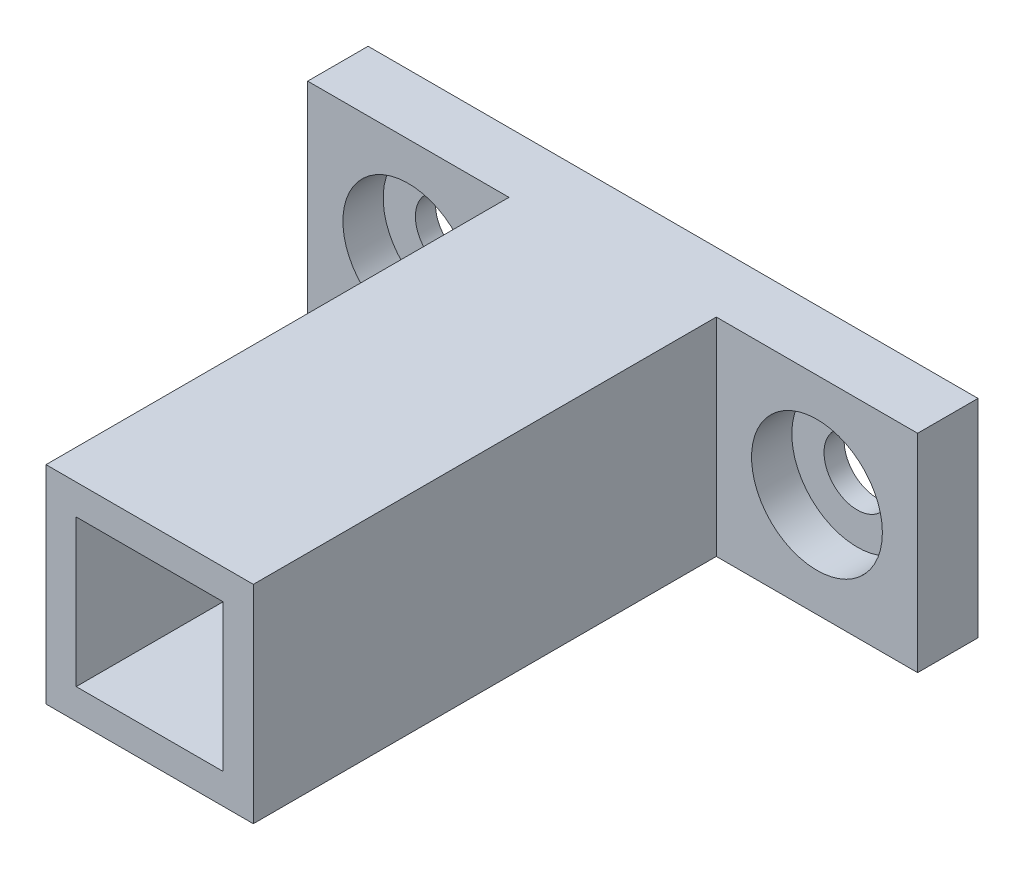
ISO-10303-21;
HEADER;
FILE_DESCRIPTION(('STEP AP214'),'2;1');
FILE_NAME('part.step','',(''),(''),'','','');
FILE_SCHEMA(('AUTOMOTIVE_DESIGN { 1 0 10303 214 1 1 1 1 }'));
ENDSEC;
DATA;
#1=APPLICATION_CONTEXT('core data for automotive mechanical design processes');
#2=APPLICATION_PROTOCOL_DEFINITION('international standard','automotive_design',2000,#1);
#3=PRODUCT_CONTEXT('',#1,'mechanical');
#4=PRODUCT('Part','Part','',(#3));
#5=PRODUCT_RELATED_PRODUCT_CATEGORY('part','',(#4));
#6=PRODUCT_DEFINITION_FORMATION('','',#4);
#7=PRODUCT_DEFINITION_CONTEXT('part definition',#1,'design');
#8=PRODUCT_DEFINITION('design','',#6,#7);
#9=PRODUCT_DEFINITION_SHAPE('','',#8);
#10=(LENGTH_UNIT() NAMED_UNIT(*) SI_UNIT(.MILLI.,.METRE.));
#11=(NAMED_UNIT(*) PLANE_ANGLE_UNIT() SI_UNIT($,.RADIAN.));
#12=(NAMED_UNIT(*) SI_UNIT($,.STERADIAN.) SOLID_ANGLE_UNIT());
#13=UNCERTAINTY_MEASURE_WITH_UNIT(LENGTH_MEASURE(1.E-05),#10,'distance_accuracy_value','');
#14=(GEOMETRIC_REPRESENTATION_CONTEXT(3) GLOBAL_UNCERTAINTY_ASSIGNED_CONTEXT((#13)) GLOBAL_UNIT_ASSIGNED_CONTEXT((#10,
#11,#12)) REPRESENTATION_CONTEXT('',''));
#15=CARTESIAN_POINT('',(0.,0.,0.));
#16=DIRECTION('',(0.,0.,1.));
#17=DIRECTION('',(1.,0.,0.));
#18=AXIS2_PLACEMENT_3D('',#15,#16,#17);
#19=CARTESIAN_POINT('',(-46.323903103577,61.9826798799258,3.));
#20=DIRECTION('',(0.,0.,-1.));
#21=DIRECTION('',(-1.,0.,0.));
#22=AXIS2_PLACEMENT_3D('',#19,#20,#21);
#23=CYLINDRICAL_SURFACE('',#22,1.65);
#24=CARTESIAN_POINT('',(-46.323903103577,61.9826798799258,0.));
#25=DIRECTION('',(0.,0.,1.));
#26=DIRECTION('',(1.,0.,0.));
#27=AXIS2_PLACEMENT_3D('',#24,#25,#26);
#28=CIRCLE('',#27,1.65);
#29=CARTESIAN_POINT('',(-44.673903103577,61.9826798799258,0.));
#30=VERTEX_POINT('',#29);
#31=EDGE_CURVE('E154',#30,#30,#28,.T.);
#32=ORIENTED_EDGE('',*,*,#31,.F.);
#33=EDGE_LOOP('',(#32));
#34=FACE_BOUND('',#33,.T.);
#35=CARTESIAN_POINT('',(-46.323903103577,61.9826798799258,1.));
#36=DIRECTION('',(0.,0.,1.));
#37=DIRECTION('',(1.,0.,0.));
#38=AXIS2_PLACEMENT_3D('',#35,#36,#37);
#39=CIRCLE('',#38,1.65);
#40=CARTESIAN_POINT('',(-44.673903103577,61.9826798799258,1.));
#41=VERTEX_POINT('',#40);
#42=EDGE_CURVE('E36',#41,#41,#39,.T.);
#43=ORIENTED_EDGE('',*,*,#42,.T.);
#44=EDGE_LOOP('',(#43));
#45=FACE_BOUND('',#44,.T.);
#46=ADVANCED_FACE('F32',(#34,#45),#23,.F.);
#47=CARTESIAN_POINT('',(-66.623903103577,61.9826798799258,3.));
#48=DIRECTION('',(0.,0.,-1.));
#49=DIRECTION('',(-1.,0.,0.));
#50=AXIS2_PLACEMENT_3D('',#47,#48,#49);
#51=CYLINDRICAL_SURFACE('',#50,1.65);
#52=CARTESIAN_POINT('',(-66.623903103577,61.9826798799258,0.));
#53=DIRECTION('',(0.,0.,1.));
#54=DIRECTION('',(1.,0.,0.));
#55=AXIS2_PLACEMENT_3D('',#52,#53,#54);
#56=CIRCLE('',#55,1.65);
#57=CARTESIAN_POINT('',(-64.973903103577,61.9826798799258,0.));
#58=VERTEX_POINT('',#57);
#59=EDGE_CURVE('E143',#58,#58,#56,.T.);
#60=ORIENTED_EDGE('',*,*,#59,.F.);
#61=EDGE_LOOP('',(#60));
#62=FACE_BOUND('',#61,.T.);
#63=CARTESIAN_POINT('',(-66.623903103577,61.9826798799258,1.));
#64=DIRECTION('',(0.,0.,1.));
#65=DIRECTION('',(1.,0.,0.));
#66=AXIS2_PLACEMENT_3D('',#63,#64,#65);
#67=CIRCLE('',#66,1.65);
#68=CARTESIAN_POINT('',(-64.973903103577,61.9826798799258,1.));
#69=VERTEX_POINT('',#68);
#70=EDGE_CURVE('E220',#69,#69,#67,.T.);
#71=ORIENTED_EDGE('',*,*,#70,.T.);
#72=EDGE_LOOP('',(#71));
#73=FACE_BOUND('',#72,.T.);
#74=ADVANCED_FACE('F263',(#62,#73),#51,.F.);
#75=CARTESIAN_POINT('',(-61.623903103577,67.1326798799259,26.));
#76=DIRECTION('',(1.,0.,0.));
#77=DIRECTION('',(0.,0.,-1.));
#78=AXIS2_PLACEMENT_3D('',#75,#76,#77);
#79=PLANE('',#78);
#80=DIRECTION('',(0.,1.,0.));
#81=VECTOR('',#80,1.);
#82=CARTESIAN_POINT('',(-61.623903103577,67.1326798799259,3.));
#83=LINE('',#82,#81);
#84=CARTESIAN_POINT('',(-61.623903103577,56.8326798799258,3.00000000000001));
#85=VERTEX_POINT('',#84);
#86=CARTESIAN_POINT('',(-61.623903103577,67.1326798799259,3.));
#87=VERTEX_POINT('',#86);
#88=EDGE_CURVE('E48',#85,#87,#83,.T.);
#89=ORIENTED_EDGE('',*,*,#88,.F.);
#90=DIRECTION('',(0.,0.,-1.));
#91=VECTOR('',#90,1.);
#92=CARTESIAN_POINT('',(-61.623903103577,56.8326798799258,26.));
#93=LINE('',#92,#91);
#94=CARTESIAN_POINT('',(-61.623903103577,56.8326798799258,26.));
#95=VERTEX_POINT('',#94);
#96=EDGE_CURVE('E41',#95,#85,#93,.T.);
#97=ORIENTED_EDGE('',*,*,#96,.F.);
#98=DIRECTION('',(0.,-1.,0.));
#99=VECTOR('',#98,1.);
#100=CARTESIAN_POINT('',(-61.623903103577,67.1326798799259,26.));
#101=LINE('',#100,#99);
#102=CARTESIAN_POINT('',(-61.623903103577,67.1326798799259,26.));
#103=VERTEX_POINT('',#102);
#104=EDGE_CURVE('E124',#103,#95,#101,.T.);
#105=ORIENTED_EDGE('',*,*,#104,.F.);
#106=DIRECTION('',(0.,0.,-1.));
#107=VECTOR('',#106,1.);
#108=CARTESIAN_POINT('',(-61.623903103577,67.1326798799259,26.));
#109=LINE('',#108,#107);
#110=EDGE_CURVE('E11',#103,#87,#109,.T.);
#111=ORIENTED_EDGE('',*,*,#110,.T.);
#112=EDGE_LOOP('',(#89,#97,#105,#111));
#113=FACE_BOUND('',#112,.T.);
#114=ADVANCED_FACE('F123',(#113),#79,.F.);
#115=CARTESIAN_POINT('',(-51.323903103577,67.1326798799259,26.));
#116=DIRECTION('',(-1.,0.,0.));
#117=DIRECTION('',(0.,0.,1.));
#118=AXIS2_PLACEMENT_3D('',#115,#116,#117);
#119=PLANE('',#118);
#120=DIRECTION('',(0.,-1.,0.));
#121=VECTOR('',#120,1.);
#122=CARTESIAN_POINT('',(-51.323903103577,67.1326798799259,3.));
#123=LINE('',#122,#121);
#124=CARTESIAN_POINT('',(-51.323903103577,67.1326798799259,3.00000000000001));
#125=VERTEX_POINT('',#124);
#126=CARTESIAN_POINT('',(-51.323903103577,56.8326798799258,3.));
#127=VERTEX_POINT('',#126);
#128=EDGE_CURVE('E56',#125,#127,#123,.T.);
#129=ORIENTED_EDGE('',*,*,#128,.F.);
#130=DIRECTION('',(0.,0.,-1.));
#131=VECTOR('',#130,1.);
#132=CARTESIAN_POINT('',(-51.323903103577,67.1326798799259,26.));
#133=LINE('',#132,#131);
#134=CARTESIAN_POINT('',(-51.323903103577,67.1326798799259,26.));
#135=VERTEX_POINT('',#134);
#136=EDGE_CURVE('E214',#135,#125,#133,.T.);
#137=ORIENTED_EDGE('',*,*,#136,.F.);
#138=DIRECTION('',(0.,1.,0.));
#139=VECTOR('',#138,1.);
#140=CARTESIAN_POINT('',(-51.323903103577,67.1326798799259,26.));
#141=LINE('',#140,#139);
#142=CARTESIAN_POINT('',(-51.323903103577,56.8326798799258,26.));
#143=VERTEX_POINT('',#142);
#144=EDGE_CURVE('E212',#143,#135,#141,.T.);
#145=ORIENTED_EDGE('',*,*,#144,.F.);
#146=DIRECTION('',(0.,0.,-1.));
#147=VECTOR('',#146,1.);
#148=CARTESIAN_POINT('',(-51.323903103577,56.8326798799258,26.));
#149=LINE('',#148,#147);
#150=EDGE_CURVE('E218',#143,#127,#149,.T.);
#151=ORIENTED_EDGE('',*,*,#150,.T.);
#152=EDGE_LOOP('',(#129,#137,#145,#151));
#153=FACE_BOUND('',#152,.T.);
#154=ADVANCED_FACE('F297',(#153),#119,.F.);
#155=CARTESIAN_POINT('',(0.,0.,26.));
#156=DIRECTION('',(0.,0.,-1.));
#157=DIRECTION('',(-1.,0.,0.));
#158=AXIS2_PLACEMENT_3D('',#155,#156,#157);
#159=PLANE('',#158);
#160=DIRECTION('',(-1.,0.,0.));
#161=VECTOR('',#160,1.);
#162=CARTESIAN_POINT('',(-61.623903103577,67.1326798799259,26.));
#163=LINE('',#162,#161);
#164=EDGE_CURVE('E206',#135,#103,#163,.T.);
#165=ORIENTED_EDGE('',*,*,#164,.T.);
#166=ORIENTED_EDGE('',*,*,#104,.T.);
#167=DIRECTION('',(1.,0.,0.));
#168=VECTOR('',#167,1.);
#169=CARTESIAN_POINT('',(-61.623903103577,56.8326798799258,26.));
#170=LINE('',#169,#168);
#171=EDGE_CURVE('E210',#95,#143,#170,.T.);
#172=ORIENTED_EDGE('',*,*,#171,.T.);
#173=ORIENTED_EDGE('',*,*,#144,.T.);
#174=EDGE_LOOP('',(#165,#166,#172,#173));
#175=FACE_BOUND('',#174,.T.);
#176=DIRECTION('',(-1.,0.,0.));
#177=VECTOR('',#176,1.);
#178=CARTESIAN_POINT('',(-60.123903103577,65.6326798799259,26.));
#179=LINE('',#178,#177);
#180=CARTESIAN_POINT('',(-52.823903103577,65.6326798799259,26.));
#181=VERTEX_POINT('',#180);
#182=CARTESIAN_POINT('',(-60.123903103577,65.6326798799259,26.));
#183=VERTEX_POINT('',#182);
#184=EDGE_CURVE('E175',#181,#183,#179,.T.);
#185=ORIENTED_EDGE('',*,*,#184,.F.);
#186=DIRECTION('',(0.,1.,0.));
#187=VECTOR('',#186,1.);
#188=CARTESIAN_POINT('',(-52.823903103577,65.6326798799259,26.));
#189=LINE('',#188,#187);
#190=CARTESIAN_POINT('',(-52.823903103577,58.3326798799258,26.));
#191=VERTEX_POINT('',#190);
#192=EDGE_CURVE('E183',#191,#181,#189,.T.);
#193=ORIENTED_EDGE('',*,*,#192,.F.);
#194=DIRECTION('',(1.,0.,0.));
#195=VECTOR('',#194,1.);
#196=CARTESIAN_POINT('',(-60.123903103577,58.3326798799258,26.));
#197=LINE('',#196,#195);
#198=CARTESIAN_POINT('',(-60.123903103577,58.3326798799258,26.));
#199=VERTEX_POINT('',#198);
#200=EDGE_CURVE('E180',#199,#191,#197,.T.);
#201=ORIENTED_EDGE('',*,*,#200,.F.);
#202=DIRECTION('',(0.,-1.,0.));
#203=VECTOR('',#202,1.);
#204=CARTESIAN_POINT('',(-60.123903103577,65.6326798799259,26.));
#205=LINE('',#204,#203);
#206=EDGE_CURVE('E177',#183,#199,#205,.T.);
#207=ORIENTED_EDGE('',*,*,#206,.F.);
#208=EDGE_LOOP('',(#185,#193,#201,#207));
#209=FACE_BOUND('',#208,.T.);
#210=ADVANCED_FACE('F293',(#175,#209),#159,.F.);
#211=CARTESIAN_POINT('',(0.,0.,0.));
#212=DIRECTION('',(0.,0.,-1.));
#213=DIRECTION('',(-1.,0.,0.));
#214=AXIS2_PLACEMENT_3D('',#211,#212,#213);
#215=PLANE('',#214);
#216=DIRECTION('',(-1.,0.,0.));
#217=VECTOR('',#216,1.);
#218=CARTESIAN_POINT('',(-61.623903103577,67.1326798799259,0.));
#219=LINE('',#218,#217);
#220=CARTESIAN_POINT('',(-41.323903103577,67.1326798799259,0.));
#221=VERTEX_POINT('',#220);
#222=CARTESIAN_POINT('',(-71.623903103577,67.1326798799259,0.));
#223=VERTEX_POINT('',#222);
#224=EDGE_CURVE('E205',#221,#223,#219,.T.);
#225=ORIENTED_EDGE('',*,*,#224,.F.);
#226=DIRECTION('',(0.,1.,0.));
#227=VECTOR('',#226,1.);
#228=CARTESIAN_POINT('',(-41.323903103577,67.1326798799259,0.));
#229=LINE('',#228,#227);
#230=CARTESIAN_POINT('',(-41.323903103577,56.8326798799258,0.));
#231=VERTEX_POINT('',#230);
#232=EDGE_CURVE('E157',#231,#221,#229,.T.);
#233=ORIENTED_EDGE('',*,*,#232,.F.);
#234=DIRECTION('',(1.,0.,0.));
#235=VECTOR('',#234,1.);
#236=CARTESIAN_POINT('',(-61.623903103577,56.8326798799258,0.));
#237=LINE('',#236,#235);
#238=CARTESIAN_POINT('',(-71.623903103577,56.8326798799258,0.));
#239=VERTEX_POINT('',#238);
#240=EDGE_CURVE('E208',#239,#231,#237,.T.);
#241=ORIENTED_EDGE('',*,*,#240,.F.);
#242=DIRECTION('',(0.,-1.,0.));
#243=VECTOR('',#242,1.);
#244=CARTESIAN_POINT('',(-71.623903103577,67.1326798799259,0.));
#245=LINE('',#244,#243);
#246=EDGE_CURVE('E140',#223,#239,#245,.T.);
#247=ORIENTED_EDGE('',*,*,#246,.F.);
#248=EDGE_LOOP('',(#225,#233,#241,#247));
#249=FACE_BOUND('',#248,.T.);
#250=DIRECTION('',(0.,1.,0.));
#251=VECTOR('',#250,1.);
#252=CARTESIAN_POINT('',(-52.823903103577,65.6326798799259,0.));
#253=LINE('',#252,#251);
#254=CARTESIAN_POINT('',(-52.823903103577,58.3326798799258,0.));
#255=VERTEX_POINT('',#254);
#256=CARTESIAN_POINT('',(-52.823903103577,65.6326798799259,0.));
#257=VERTEX_POINT('',#256);
#258=EDGE_CURVE('E178',#255,#257,#253,.T.);
#259=ORIENTED_EDGE('',*,*,#258,.T.);
#260=DIRECTION('',(-1.,0.,0.));
#261=VECTOR('',#260,1.);
#262=CARTESIAN_POINT('',(-60.123903103577,65.6326798799259,0.));
#263=LINE('',#262,#261);
#264=CARTESIAN_POINT('',(-60.123903103577,65.6326798799259,0.));
#265=VERTEX_POINT('',#264);
#266=EDGE_CURVE('E174',#257,#265,#263,.T.);
#267=ORIENTED_EDGE('',*,*,#266,.T.);
#268=DIRECTION('',(0.,-1.,0.));
#269=VECTOR('',#268,1.);
#270=CARTESIAN_POINT('',(-60.123903103577,65.6326798799259,0.));
#271=LINE('',#270,#269);
#272=CARTESIAN_POINT('',(-60.123903103577,58.3326798799258,0.));
#273=VERTEX_POINT('',#272);
#274=EDGE_CURVE('E188',#265,#273,#271,.T.);
#275=ORIENTED_EDGE('',*,*,#274,.T.);
#276=DIRECTION('',(1.,0.,0.));
#277=VECTOR('',#276,1.);
#278=CARTESIAN_POINT('',(-60.123903103577,58.3326798799258,0.));
#279=LINE('',#278,#277);
#280=EDGE_CURVE('E191',#273,#255,#279,.T.);
#281=ORIENTED_EDGE('',*,*,#280,.T.);
#282=EDGE_LOOP('',(#259,#267,#275,#281));
#283=FACE_BOUND('',#282,.T.);
#284=ORIENTED_EDGE('',*,*,#31,.T.);
#285=EDGE_LOOP('',(#284));
#286=FACE_BOUND('',#285,.T.);
#287=ORIENTED_EDGE('',*,*,#59,.T.);
#288=EDGE_LOOP('',(#287));
#289=FACE_BOUND('',#288,.T.);
#290=ADVANCED_FACE('F296',(#249,#283,#286,#289),#215,.T.);
#291=CARTESIAN_POINT('',(-61.623903103577,67.1326798799259,26.));
#292=DIRECTION('',(0.,-1.,0.));
#293=DIRECTION('',(0.,0.,-1.));
#294=AXIS2_PLACEMENT_3D('',#291,#292,#293);
#295=PLANE('',#294);
#296=ORIENTED_EDGE('',*,*,#224,.T.);
#297=DIRECTION('',(0.,0.,-1.));
#298=VECTOR('',#297,1.);
#299=CARTESIAN_POINT('',(-71.623903103577,67.1326798799259,3.));
#300=LINE('',#299,#298);
#301=CARTESIAN_POINT('',(-71.623903103577,67.1326798799259,3.));
#302=VERTEX_POINT('',#301);
#303=EDGE_CURVE('E131',#302,#223,#300,.T.);
#304=ORIENTED_EDGE('',*,*,#303,.F.);
#305=DIRECTION('',(-1.,0.,0.));
#306=VECTOR('',#305,1.);
#307=CARTESIAN_POINT('',(-61.623903103577,67.1326798799259,3.));
#308=LINE('',#307,#306);
#309=EDGE_CURVE('E129',#87,#302,#308,.T.);
#310=ORIENTED_EDGE('',*,*,#309,.F.);
#311=ORIENTED_EDGE('',*,*,#110,.F.);
#312=ORIENTED_EDGE('',*,*,#164,.F.);
#313=ORIENTED_EDGE('',*,*,#136,.T.);
#314=DIRECTION('',(-1.,0.,0.));
#315=VECTOR('',#314,1.);
#316=CARTESIAN_POINT('',(-51.323903103577,67.1326798799259,3.));
#317=LINE('',#316,#315);
#318=CARTESIAN_POINT('',(-41.323903103577,67.1326798799259,3.));
#319=VERTEX_POINT('',#318);
#320=EDGE_CURVE('E163',#319,#125,#317,.T.);
#321=ORIENTED_EDGE('',*,*,#320,.F.);
#322=DIRECTION('',(0.,0.,-1.));
#323=VECTOR('',#322,1.);
#324=CARTESIAN_POINT('',(-41.323903103577,67.1326798799259,3.));
#325=LINE('',#324,#323);
#326=EDGE_CURVE('E166',#319,#221,#325,.T.);
#327=ORIENTED_EDGE('',*,*,#326,.T.);
#328=EDGE_LOOP('',(#296,#304,#310,#311,#312,#313,#321,#327));
#329=FACE_BOUND('',#328,.T.);
#330=ADVANCED_FACE('F34',(#329),#295,.F.);
#331=CARTESIAN_POINT('',(-61.623903103577,56.8326798799258,26.));
#332=DIRECTION('',(0.,1.,0.));
#333=DIRECTION('',(0.,0.,1.));
#334=AXIS2_PLACEMENT_3D('',#331,#332,#333);
#335=PLANE('',#334);
#336=ORIENTED_EDGE('',*,*,#240,.T.);
#337=DIRECTION('',(0.,0.,-1.));
#338=VECTOR('',#337,1.);
#339=CARTESIAN_POINT('',(-41.323903103577,56.8326798799258,3.));
#340=LINE('',#339,#338);
#341=CARTESIAN_POINT('',(-41.323903103577,56.8326798799258,3.));
#342=VERTEX_POINT('',#341);
#343=EDGE_CURVE('E171',#342,#231,#340,.T.);
#344=ORIENTED_EDGE('',*,*,#343,.F.);
#345=DIRECTION('',(1.,0.,0.));
#346=VECTOR('',#345,1.);
#347=CARTESIAN_POINT('',(-51.323903103577,56.8326798799258,3.));
#348=LINE('',#347,#346);
#349=EDGE_CURVE('E159',#127,#342,#348,.T.);
#350=ORIENTED_EDGE('',*,*,#349,.F.);
#351=ORIENTED_EDGE('',*,*,#150,.F.);
#352=ORIENTED_EDGE('',*,*,#171,.F.);
#353=ORIENTED_EDGE('',*,*,#96,.T.);
#354=DIRECTION('',(1.,0.,0.));
#355=VECTOR('',#354,1.);
#356=CARTESIAN_POINT('',(-61.623903103577,56.8326798799258,3.));
#357=LINE('',#356,#355);
#358=CARTESIAN_POINT('',(-71.623903103577,56.8326798799258,3.));
#359=VERTEX_POINT('',#358);
#360=EDGE_CURVE('E139',#359,#85,#357,.T.);
#361=ORIENTED_EDGE('',*,*,#360,.F.);
#362=DIRECTION('',(0.,0.,-1.));
#363=VECTOR('',#362,1.);
#364=CARTESIAN_POINT('',(-71.623903103577,56.8326798799258,3.));
#365=LINE('',#364,#363);
#366=EDGE_CURVE('E149',#359,#239,#365,.T.);
#367=ORIENTED_EDGE('',*,*,#366,.T.);
#368=EDGE_LOOP('',(#336,#344,#350,#351,#352,#353,#361,#367));
#369=FACE_BOUND('',#368,.T.);
#370=ADVANCED_FACE('F291',(#369),#335,.F.);
#371=CARTESIAN_POINT('',(-60.123903103577,65.6326798799259,26.));
#372=DIRECTION('',(0.,-1.,0.));
#373=DIRECTION('',(1.,0.,0.));
#374=AXIS2_PLACEMENT_3D('',#371,#372,#373);
#375=PLANE('',#374);
#376=ORIENTED_EDGE('',*,*,#266,.F.);
#377=DIRECTION('',(0.,0.,-1.));
#378=VECTOR('',#377,1.);
#379=CARTESIAN_POINT('',(-52.823903103577,65.6326798799259,26.));
#380=LINE('',#379,#378);
#381=EDGE_CURVE('E185',#181,#257,#380,.T.);
#382=ORIENTED_EDGE('',*,*,#381,.F.);
#383=ORIENTED_EDGE('',*,*,#184,.T.);
#384=DIRECTION('',(0.,0.,-1.));
#385=VECTOR('',#384,1.);
#386=CARTESIAN_POINT('',(-60.123903103577,65.6326798799259,26.));
#387=LINE('',#386,#385);
#388=EDGE_CURVE('E202',#183,#265,#387,.T.);
#389=ORIENTED_EDGE('',*,*,#388,.T.);
#390=EDGE_LOOP('',(#376,#382,#383,#389));
#391=FACE_BOUND('',#390,.T.);
#392=ADVANCED_FACE('F287',(#391),#375,.T.);
#393=CARTESIAN_POINT('',(-60.123903103577,65.6326798799259,26.));
#394=DIRECTION('',(1.,0.,0.));
#395=DIRECTION('',(0.,0.,-1.));
#396=AXIS2_PLACEMENT_3D('',#393,#394,#395);
#397=PLANE('',#396);
#398=ORIENTED_EDGE('',*,*,#274,.F.);
#399=ORIENTED_EDGE('',*,*,#388,.F.);
#400=ORIENTED_EDGE('',*,*,#206,.T.);
#401=DIRECTION('',(0.,0.,-1.));
#402=VECTOR('',#401,1.);
#403=CARTESIAN_POINT('',(-60.123903103577,58.3326798799258,26.));
#404=LINE('',#403,#402);
#405=EDGE_CURVE('E200',#199,#273,#404,.T.);
#406=ORIENTED_EDGE('',*,*,#405,.T.);
#407=EDGE_LOOP('',(#398,#399,#400,#406));
#408=FACE_BOUND('',#407,.T.);
#409=ADVANCED_FACE('F283',(#408),#397,.T.);
#410=CARTESIAN_POINT('',(-60.123903103577,58.3326798799258,26.));
#411=DIRECTION('',(0.,1.,0.));
#412=DIRECTION('',(-1.,0.,0.));
#413=AXIS2_PLACEMENT_3D('',#410,#411,#412);
#414=PLANE('',#413);
#415=ORIENTED_EDGE('',*,*,#280,.F.);
#416=ORIENTED_EDGE('',*,*,#405,.F.);
#417=ORIENTED_EDGE('',*,*,#200,.T.);
#418=DIRECTION('',(0.,0.,-1.));
#419=VECTOR('',#418,1.);
#420=CARTESIAN_POINT('',(-52.823903103577,58.3326798799258,26.));
#421=LINE('',#420,#419);
#422=EDGE_CURVE('E198',#191,#255,#421,.T.);
#423=ORIENTED_EDGE('',*,*,#422,.T.);
#424=EDGE_LOOP('',(#415,#416,#417,#423));
#425=FACE_BOUND('',#424,.T.);
#426=ADVANCED_FACE('F279',(#425),#414,.T.);
#427=CARTESIAN_POINT('',(-52.823903103577,65.6326798799259,26.));
#428=DIRECTION('',(-1.,0.,0.));
#429=DIRECTION('',(0.,0.,1.));
#430=AXIS2_PLACEMENT_3D('',#427,#428,#429);
#431=PLANE('',#430);
#432=ORIENTED_EDGE('',*,*,#258,.F.);
#433=ORIENTED_EDGE('',*,*,#422,.F.);
#434=ORIENTED_EDGE('',*,*,#192,.T.);
#435=ORIENTED_EDGE('',*,*,#381,.T.);
#436=EDGE_LOOP('',(#432,#433,#434,#435));
#437=FACE_BOUND('',#436,.T.);
#438=ADVANCED_FACE('F274',(#437),#431,.T.);
#439=CARTESIAN_POINT('',(0.,0.,3.));
#440=DIRECTION('',(0.,0.,1.));
#441=DIRECTION('',(1.,0.,0.));
#442=AXIS2_PLACEMENT_3D('',#439,#440,#441);
#443=PLANE('',#442);
#444=CARTESIAN_POINT('',(-46.323903103577,61.9826798799258,3.));
#445=DIRECTION('',(0.,0.,1.));
#446=DIRECTION('',(1.,0.,0.));
#447=AXIS2_PLACEMENT_3D('',#444,#445,#446);
#448=CIRCLE('',#447,3.25);
#449=CARTESIAN_POINT('',(-43.073903103577,61.9826798799258,3.));
#450=VERTEX_POINT('',#449);
#451=EDGE_CURVE('E227',#450,#450,#448,.T.);
#452=ORIENTED_EDGE('',*,*,#451,.F.);
#453=EDGE_LOOP('',(#452));
#454=FACE_BOUND('',#453,.T.);
#455=ORIENTED_EDGE('',*,*,#128,.T.);
#456=ORIENTED_EDGE('',*,*,#349,.T.);
#457=DIRECTION('',(0.,1.,0.));
#458=VECTOR('',#457,1.);
#459=CARTESIAN_POINT('',(-41.323903103577,67.1326798799259,3.));
#460=LINE('',#459,#458);
#461=EDGE_CURVE('E161',#342,#319,#460,.T.);
#462=ORIENTED_EDGE('',*,*,#461,.T.);
#463=ORIENTED_EDGE('',*,*,#320,.T.);
#464=EDGE_LOOP('',(#455,#456,#462,#463));
#465=FACE_BOUND('',#464,.T.);
#466=ADVANCED_FACE('F258',(#454,#465),#443,.T.);
#467=CARTESIAN_POINT('',(-41.323903103577,67.1326798799259,3.));
#468=DIRECTION('',(-1.,0.,0.));
#469=DIRECTION('',(0.,0.,1.));
#470=AXIS2_PLACEMENT_3D('',#467,#468,#469);
#471=PLANE('',#470);
#472=ORIENTED_EDGE('',*,*,#232,.T.);
#473=ORIENTED_EDGE('',*,*,#326,.F.);
#474=ORIENTED_EDGE('',*,*,#461,.F.);
#475=ORIENTED_EDGE('',*,*,#343,.T.);
#476=EDGE_LOOP('',(#472,#473,#474,#475));
#477=FACE_BOUND('',#476,.T.);
#478=ADVANCED_FACE('F250',(#477),#471,.F.);
#479=CARTESIAN_POINT('',(0.,0.,3.));
#480=DIRECTION('',(0.,0.,-1.));
#481=DIRECTION('',(-1.,0.,0.));
#482=AXIS2_PLACEMENT_3D('',#479,#480,#481);
#483=PLANE('',#482);
#484=CARTESIAN_POINT('',(-66.623903103577,61.9826798799258,3.));
#485=DIRECTION('',(0.,0.,1.));
#486=DIRECTION('',(1.,0.,0.));
#487=AXIS2_PLACEMENT_3D('',#484,#485,#486);
#488=CIRCLE('',#487,3.25000000000001);
#489=CARTESIAN_POINT('',(-63.373903103577,61.9826798799258,3.));
#490=VERTEX_POINT('',#489);
#491=EDGE_CURVE('E232',#490,#490,#488,.T.);
#492=ORIENTED_EDGE('',*,*,#491,.F.);
#493=EDGE_LOOP('',(#492));
#494=FACE_BOUND('',#493,.T.);
#495=ORIENTED_EDGE('',*,*,#88,.T.);
#496=ORIENTED_EDGE('',*,*,#309,.T.);
#497=DIRECTION('',(0.,-1.,0.));
#498=VECTOR('',#497,1.);
#499=CARTESIAN_POINT('',(-71.623903103577,67.1326798799259,3.));
#500=LINE('',#499,#498);
#501=EDGE_CURVE('E134',#302,#359,#500,.T.);
#502=ORIENTED_EDGE('',*,*,#501,.T.);
#503=ORIENTED_EDGE('',*,*,#360,.T.);
#504=EDGE_LOOP('',(#495,#496,#502,#503));
#505=FACE_BOUND('',#504,.T.);
#506=ADVANCED_FACE('F137',(#494,#505),#483,.F.);
#507=CARTESIAN_POINT('',(-71.623903103577,67.1326798799259,3.));
#508=DIRECTION('',(1.,0.,0.));
#509=DIRECTION('',(0.,0.,-1.));
#510=AXIS2_PLACEMENT_3D('',#507,#508,#509);
#511=PLANE('',#510);
#512=ORIENTED_EDGE('',*,*,#246,.T.);
#513=ORIENTED_EDGE('',*,*,#366,.F.);
#514=ORIENTED_EDGE('',*,*,#501,.F.);
#515=ORIENTED_EDGE('',*,*,#303,.T.);
#516=EDGE_LOOP('',(#512,#513,#514,#515));
#517=FACE_BOUND('',#516,.T.);
#518=ADVANCED_FACE('F245',(#517),#511,.F.);
#519=CARTESIAN_POINT('',(-66.623903103577,61.9826798799258,1.));
#520=DIRECTION('',(0.,0.,1.));
#521=DIRECTION('',(1.,0.,0.));
#522=AXIS2_PLACEMENT_3D('',#519,#520,#521);
#523=CYLINDRICAL_SURFACE('',#522,3.25000000000001);
#524=CARTESIAN_POINT('',(-66.623903103577,61.9826798799258,1.));
#525=DIRECTION('',(0.,0.,1.));
#526=DIRECTION('',(1.,0.,0.));
#527=AXIS2_PLACEMENT_3D('',#524,#525,#526);
#528=CIRCLE('',#527,3.25000000000001);
#529=CARTESIAN_POINT('',(-63.373903103577,61.9826798799258,1.));
#530=VERTEX_POINT('',#529);
#531=EDGE_CURVE('E236',#530,#530,#528,.T.);
#532=ORIENTED_EDGE('',*,*,#531,.F.);
#533=EDGE_LOOP('',(#532));
#534=FACE_BOUND('',#533,.T.);
#535=ORIENTED_EDGE('',*,*,#491,.T.);
#536=EDGE_LOOP('',(#535));
#537=FACE_BOUND('',#536,.T.);
#538=ADVANCED_FACE('F242',(#534,#537),#523,.F.);
#539=CARTESIAN_POINT('',(-66.623903103577,61.9826798799258,1.));
#540=DIRECTION('',(0.,0.,1.));
#541=DIRECTION('',(1.,0.,0.));
#542=AXIS2_PLACEMENT_3D('',#539,#540,#541);
#543=PLANE('',#542);
#544=ORIENTED_EDGE('',*,*,#70,.F.);
#545=EDGE_LOOP('',(#544));
#546=FACE_BOUND('',#545,.T.);
#547=ORIENTED_EDGE('',*,*,#531,.T.);
#548=EDGE_LOOP('',(#547));
#549=FACE_BOUND('',#548,.T.);
#550=ADVANCED_FACE('F240',(#546,#549),#543,.T.);
#551=CARTESIAN_POINT('',(-46.323903103577,61.9826798799258,1.));
#552=DIRECTION('',(0.,0.,1.));
#553=DIRECTION('',(1.,0.,0.));
#554=AXIS2_PLACEMENT_3D('',#551,#552,#553);
#555=CYLINDRICAL_SURFACE('',#554,3.25);
#556=CARTESIAN_POINT('',(-46.323903103577,61.9826798799258,1.));
#557=DIRECTION('',(0.,0.,1.));
#558=DIRECTION('',(1.,0.,0.));
#559=AXIS2_PLACEMENT_3D('',#556,#557,#558);
#560=CIRCLE('',#559,3.25);
#561=CARTESIAN_POINT('',(-43.073903103577,61.9826798799258,1.));
#562=VERTEX_POINT('',#561);
#563=EDGE_CURVE('E222',#562,#562,#560,.T.);
#564=ORIENTED_EDGE('',*,*,#563,.F.);
#565=EDGE_LOOP('',(#564));
#566=FACE_BOUND('',#565,.T.);
#567=ORIENTED_EDGE('',*,*,#451,.T.);
#568=EDGE_LOOP('',(#567));
#569=FACE_BOUND('',#568,.T.);
#570=ADVANCED_FACE('F386',(#566,#569),#555,.F.);
#571=CARTESIAN_POINT('',(-46.323903103577,61.9826798799258,1.));
#572=DIRECTION('',(0.,0.,1.));
#573=DIRECTION('',(1.,0.,0.));
#574=AXIS2_PLACEMENT_3D('',#571,#572,#573);
#575=PLANE('',#574);
#576=ORIENTED_EDGE('',*,*,#42,.F.);
#577=EDGE_LOOP('',(#576));
#578=FACE_BOUND('',#577,.T.);
#579=ORIENTED_EDGE('',*,*,#563,.T.);
#580=EDGE_LOOP('',(#579));
#581=FACE_BOUND('',#580,.T.);
#582=ADVANCED_FACE('F395',(#578,#581),#575,.T.);
#583=CLOSED_SHELL('',(#46,#74,#114,#154,#210,#290,#330,#370,#392,#409,#426,#438,#466,#478,#506,
#518,#538,#550,#570,#582));
#584=MANIFOLD_SOLID_BREP('B2',#583);
#585=ADVANCED_BREP_SHAPE_REPRESENTATION('',(#18,#584),#14);
#586=SHAPE_DEFINITION_REPRESENTATION(#9,#585);
ENDSEC;
END-ISO-10303-21;
